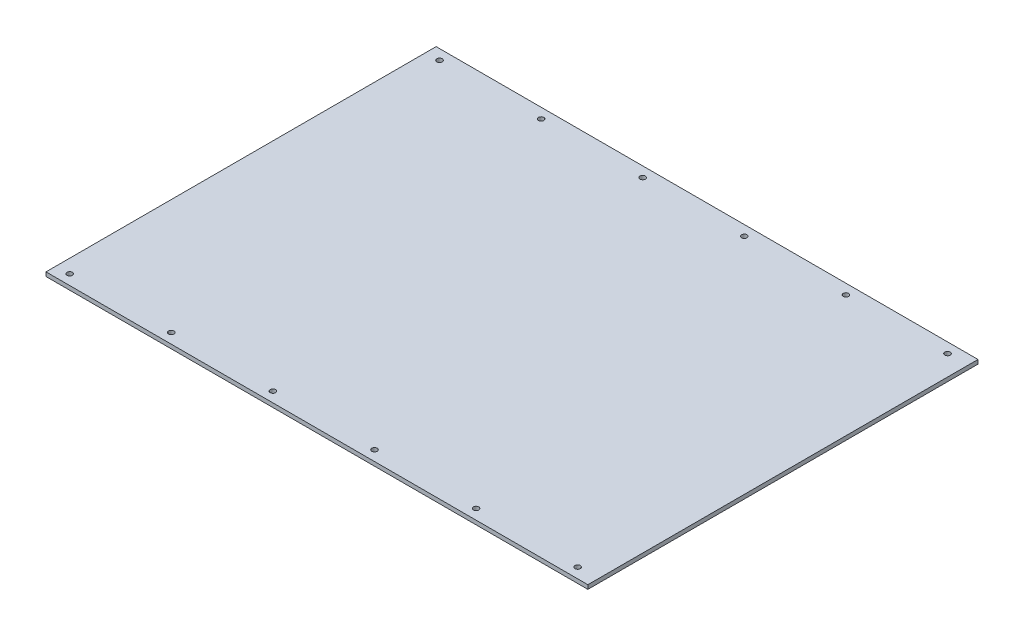
ISO-10303-21;
HEADER;
FILE_DESCRIPTION(('STEP AP214'),'2;1');
FILE_NAME('part.step','',(''),(''),'','','');
FILE_SCHEMA(('AUTOMOTIVE_DESIGN { 1 0 10303 214 1 1 1 1 }'));
ENDSEC;
DATA;
#1=APPLICATION_CONTEXT('core data for automotive mechanical design processes');
#2=APPLICATION_PROTOCOL_DEFINITION('international standard','automotive_design',2000,#1);
#3=PRODUCT_CONTEXT('',#1,'mechanical');
#4=PRODUCT('Part','Part','',(#3));
#5=PRODUCT_RELATED_PRODUCT_CATEGORY('part','',(#4));
#6=PRODUCT_DEFINITION_FORMATION('','',#4);
#7=PRODUCT_DEFINITION_CONTEXT('part definition',#1,'design');
#8=PRODUCT_DEFINITION('design','',#6,#7);
#9=PRODUCT_DEFINITION_SHAPE('','',#8);
#10=(LENGTH_UNIT() NAMED_UNIT(*) SI_UNIT(.MILLI.,.METRE.));
#11=(NAMED_UNIT(*) PLANE_ANGLE_UNIT() SI_UNIT($,.RADIAN.));
#12=(NAMED_UNIT(*) SI_UNIT($,.STERADIAN.) SOLID_ANGLE_UNIT());
#13=UNCERTAINTY_MEASURE_WITH_UNIT(LENGTH_MEASURE(1.E-05),#10,'distance_accuracy_value','');
#14=(GEOMETRIC_REPRESENTATION_CONTEXT(3) GLOBAL_UNCERTAINTY_ASSIGNED_CONTEXT((#13)) GLOBAL_UNIT_ASSIGNED_CONTEXT((#10,
#11,#12)) REPRESENTATION_CONTEXT('',''));
#15=CARTESIAN_POINT('',(0.,0.,0.));
#16=DIRECTION('',(0.,0.,1.));
#17=DIRECTION('',(1.,0.,0.));
#18=AXIS2_PLACEMENT_3D('',#15,#16,#17);
#19=CARTESIAN_POINT('',(-200.,3.,144.));
#20=DIRECTION('',(1.,0.,0.));
#21=DIRECTION('',(0.,0.,-1.));
#22=AXIS2_PLACEMENT_3D('',#19,#20,#21);
#23=PLANE('',#22);
#24=DIRECTION('',(0.,0.,1.));
#25=VECTOR('',#24,1.);
#26=CARTESIAN_POINT('',(-200.,0.,144.));
#27=LINE('',#26,#25);
#28=CARTESIAN_POINT('',(-200.,0.,-144.));
#29=VERTEX_POINT('',#28);
#30=CARTESIAN_POINT('',(-200.,0.,144.));
#31=VERTEX_POINT('',#30);
#32=EDGE_CURVE('E98',#29,#31,#27,.T.);
#33=ORIENTED_EDGE('',*,*,#32,.T.);
#34=DIRECTION('',(0.,-1.,0.));
#35=VECTOR('',#34,1.);
#36=CARTESIAN_POINT('',(-200.,3.,144.));
#37=LINE('',#36,#35);
#38=CARTESIAN_POINT('',(-200.,3.,144.));
#39=VERTEX_POINT('',#38);
#40=EDGE_CURVE('E11',#39,#31,#37,.T.);
#41=ORIENTED_EDGE('',*,*,#40,.F.);
#42=DIRECTION('',(0.,0.,1.));
#43=VECTOR('',#42,1.);
#44=CARTESIAN_POINT('',(-200.,3.,144.));
#45=LINE('',#44,#43);
#46=CARTESIAN_POINT('',(-200.,3.,-144.));
#47=VERTEX_POINT('',#46);
#48=EDGE_CURVE('E85',#47,#39,#45,.T.);
#49=ORIENTED_EDGE('',*,*,#48,.F.);
#50=DIRECTION('',(0.,-1.,0.));
#51=VECTOR('',#50,1.);
#52=CARTESIAN_POINT('',(-200.,3.,-144.));
#53=LINE('',#52,#51);
#54=EDGE_CURVE('E94',#47,#29,#53,.T.);
#55=ORIENTED_EDGE('',*,*,#54,.T.);
#56=EDGE_LOOP('',(#33,#41,#49,#55));
#57=FACE_BOUND('',#56,.T.);
#58=ADVANCED_FACE('F32',(#57),#23,.F.);
#59=CARTESIAN_POINT('',(200.,3.,144.));
#60=DIRECTION('',(0.,0.,-1.));
#61=DIRECTION('',(-1.,0.,0.));
#62=AXIS2_PLACEMENT_3D('',#59,#60,#61);
#63=PLANE('',#62);
#64=DIRECTION('',(1.,0.,0.));
#65=VECTOR('',#64,1.);
#66=CARTESIAN_POINT('',(200.,0.,144.));
#67=LINE('',#66,#65);
#68=CARTESIAN_POINT('',(200.,0.,144.));
#69=VERTEX_POINT('',#68);
#70=EDGE_CURVE('E89',#31,#69,#67,.T.);
#71=ORIENTED_EDGE('',*,*,#70,.T.);
#72=DIRECTION('',(0.,-1.,0.));
#73=VECTOR('',#72,1.);
#74=CARTESIAN_POINT('',(200.,3.,144.));
#75=LINE('',#74,#73);
#76=CARTESIAN_POINT('',(200.,3.,144.));
#77=VERTEX_POINT('',#76);
#78=EDGE_CURVE('E41',#77,#69,#75,.T.);
#79=ORIENTED_EDGE('',*,*,#78,.F.);
#80=DIRECTION('',(1.,0.,0.));
#81=VECTOR('',#80,1.);
#82=CARTESIAN_POINT('',(200.,3.,144.));
#83=LINE('',#82,#81);
#84=EDGE_CURVE('E80',#39,#77,#83,.T.);
#85=ORIENTED_EDGE('',*,*,#84,.F.);
#86=ORIENTED_EDGE('',*,*,#40,.T.);
#87=EDGE_LOOP('',(#71,#79,#85,#86));
#88=FACE_BOUND('',#87,.T.);
#89=ADVANCED_FACE('F88',(#88),#63,.F.);
#90=CARTESIAN_POINT('',(200.,3.,144.));
#91=DIRECTION('',(-1.,0.,0.));
#92=DIRECTION('',(0.,0.,1.));
#93=AXIS2_PLACEMENT_3D('',#90,#91,#92);
#94=PLANE('',#93);
#95=DIRECTION('',(0.,0.,-1.));
#96=VECTOR('',#95,1.);
#97=CARTESIAN_POINT('',(200.,0.,144.));
#98=LINE('',#97,#96);
#99=CARTESIAN_POINT('',(200.,0.,-144.));
#100=VERTEX_POINT('',#99);
#101=EDGE_CURVE('E67',#69,#100,#98,.T.);
#102=ORIENTED_EDGE('',*,*,#101,.T.);
#103=DIRECTION('',(0.,-1.,0.));
#104=VECTOR('',#103,1.);
#105=CARTESIAN_POINT('',(200.,3.,-144.));
#106=LINE('',#105,#104);
#107=CARTESIAN_POINT('',(200.,3.,-144.));
#108=VERTEX_POINT('',#107);
#109=EDGE_CURVE('E90',#108,#100,#106,.T.);
#110=ORIENTED_EDGE('',*,*,#109,.F.);
#111=DIRECTION('',(0.,0.,-1.));
#112=VECTOR('',#111,1.);
#113=CARTESIAN_POINT('',(200.,3.,144.));
#114=LINE('',#113,#112);
#115=EDGE_CURVE('E83',#77,#108,#114,.T.);
#116=ORIENTED_EDGE('',*,*,#115,.F.);
#117=ORIENTED_EDGE('',*,*,#78,.T.);
#118=EDGE_LOOP('',(#102,#110,#116,#117));
#119=FACE_BOUND('',#118,.T.);
#120=ADVANCED_FACE('F92',(#119),#94,.F.);
#121=CARTESIAN_POINT('',(200.,3.,-144.));
#122=DIRECTION('',(0.,0.,1.));
#123=DIRECTION('',(1.,0.,0.));
#124=AXIS2_PLACEMENT_3D('',#121,#122,#123);
#125=PLANE('',#124);
#126=DIRECTION('',(-1.,0.,0.));
#127=VECTOR('',#126,1.);
#128=CARTESIAN_POINT('',(200.,0.,-144.));
#129=LINE('',#128,#127);
#130=EDGE_CURVE('E73',#100,#29,#129,.T.);
#131=ORIENTED_EDGE('',*,*,#130,.T.);
#132=ORIENTED_EDGE('',*,*,#54,.F.);
#133=DIRECTION('',(-1.,0.,0.));
#134=VECTOR('',#133,1.);
#135=CARTESIAN_POINT('',(200.,3.,-144.));
#136=LINE('',#135,#134);
#137=EDGE_CURVE('E50',#108,#47,#136,.T.);
#138=ORIENTED_EDGE('',*,*,#137,.F.);
#139=ORIENTED_EDGE('',*,*,#109,.T.);
#140=EDGE_LOOP('',(#131,#132,#138,#139));
#141=FACE_BOUND('',#140,.T.);
#142=ADVANCED_FACE('F175',(#141),#125,.F.);
#143=CARTESIAN_POINT('',(0.,3.,0.));
#144=DIRECTION('',(0.,1.,0.));
#145=DIRECTION('',(0.,0.,1.));
#146=AXIS2_PLACEMENT_3D('',#143,#144,#145);
#147=PLANE('',#146);
#148=CARTESIAN_POINT('',(35.,3.,136.5));
#149=DIRECTION('',(0.,1.,0.));
#150=DIRECTION('',(0.,0.,-1.));
#151=AXIS2_PLACEMENT_3D('',#148,#149,#150);
#152=CIRCLE('',#151,2.);
#153=CARTESIAN_POINT('',(35.,3.,134.5));
#154=VERTEX_POINT('',#153);
#155=EDGE_CURVE('E346',#154,#154,#152,.T.);
#156=ORIENTED_EDGE('',*,*,#155,.F.);
#157=EDGE_LOOP('',(#156));
#158=FACE_BOUND('',#157,.T.);
#159=CARTESIAN_POINT('',(110.,3.,136.5));
#160=DIRECTION('',(0.,1.,0.));
#161=DIRECTION('',(0.,0.,-1.));
#162=AXIS2_PLACEMENT_3D('',#159,#160,#161);
#163=CIRCLE('',#162,2.);
#164=CARTESIAN_POINT('',(110.,3.,134.5));
#165=VERTEX_POINT('',#164);
#166=EDGE_CURVE('E340',#165,#165,#163,.T.);
#167=ORIENTED_EDGE('',*,*,#166,.F.);
#168=EDGE_LOOP('',(#167));
#169=FACE_BOUND('',#168,.T.);
#170=CARTESIAN_POINT('',(185.,3.,136.5));
#171=DIRECTION('',(0.,1.,0.));
#172=DIRECTION('',(0.,0.,-1.));
#173=AXIS2_PLACEMENT_3D('',#170,#171,#172);
#174=CIRCLE('',#173,2.);
#175=CARTESIAN_POINT('',(185.,3.,134.5));
#176=VERTEX_POINT('',#175);
#177=EDGE_CURVE('E308',#176,#176,#174,.T.);
#178=ORIENTED_EDGE('',*,*,#177,.F.);
#179=EDGE_LOOP('',(#178));
#180=FACE_BOUND('',#179,.T.);
#181=CARTESIAN_POINT('',(185.,3.,-136.5));
#182=DIRECTION('',(0.,1.,0.));
#183=DIRECTION('',(0.,0.,1.));
#184=AXIS2_PLACEMENT_3D('',#181,#182,#183);
#185=CIRCLE('',#184,2.);
#186=CARTESIAN_POINT('',(185.,3.,-134.5));
#187=VERTEX_POINT('',#186);
#188=EDGE_CURVE('E339',#187,#187,#185,.T.);
#189=ORIENTED_EDGE('',*,*,#188,.F.);
#190=EDGE_LOOP('',(#189));
#191=FACE_BOUND('',#190,.T.);
#192=CARTESIAN_POINT('',(110.,3.,-136.5));
#193=DIRECTION('',(0.,1.,0.));
#194=DIRECTION('',(0.,0.,1.));
#195=AXIS2_PLACEMENT_3D('',#192,#193,#194);
#196=CIRCLE('',#195,2.);
#197=CARTESIAN_POINT('',(110.,3.,-134.5));
#198=VERTEX_POINT('',#197);
#199=EDGE_CURVE('E343',#198,#198,#196,.T.);
#200=ORIENTED_EDGE('',*,*,#199,.F.);
#201=EDGE_LOOP('',(#200));
#202=FACE_BOUND('',#201,.T.);
#203=CARTESIAN_POINT('',(35.,3.,-136.5));
#204=DIRECTION('',(0.,1.,0.));
#205=DIRECTION('',(0.,0.,1.));
#206=AXIS2_PLACEMENT_3D('',#203,#204,#205);
#207=CIRCLE('',#206,2.);
#208=CARTESIAN_POINT('',(35.,3.,-134.5));
#209=VERTEX_POINT('',#208);
#210=EDGE_CURVE('E358',#209,#209,#207,.T.);
#211=ORIENTED_EDGE('',*,*,#210,.F.);
#212=EDGE_LOOP('',(#211));
#213=FACE_BOUND('',#212,.T.);
#214=CARTESIAN_POINT('',(-40.,3.,-136.5));
#215=DIRECTION('',(0.,1.,0.));
#216=DIRECTION('',(0.,0.,1.));
#217=AXIS2_PLACEMENT_3D('',#214,#215,#216);
#218=CIRCLE('',#217,2.);
#219=CARTESIAN_POINT('',(-40.,3.,-134.5));
#220=VERTEX_POINT('',#219);
#221=EDGE_CURVE('E355',#220,#220,#218,.T.);
#222=ORIENTED_EDGE('',*,*,#221,.F.);
#223=EDGE_LOOP('',(#222));
#224=FACE_BOUND('',#223,.T.);
#225=CARTESIAN_POINT('',(-115.,3.,-136.5));
#226=DIRECTION('',(0.,1.,0.));
#227=DIRECTION('',(0.,0.,1.));
#228=AXIS2_PLACEMENT_3D('',#225,#226,#227);
#229=CIRCLE('',#228,2.);
#230=CARTESIAN_POINT('',(-115.,3.,-134.5));
#231=VERTEX_POINT('',#230);
#232=EDGE_CURVE('E352',#231,#231,#229,.T.);
#233=ORIENTED_EDGE('',*,*,#232,.F.);
#234=EDGE_LOOP('',(#233));
#235=FACE_BOUND('',#234,.T.);
#236=CARTESIAN_POINT('',(-40.,3.,136.5));
#237=DIRECTION('',(0.,1.,0.));
#238=DIRECTION('',(0.,0.,-1.));
#239=AXIS2_PLACEMENT_3D('',#236,#237,#238);
#240=CIRCLE('',#239,2.);
#241=CARTESIAN_POINT('',(-40.,3.,134.5));
#242=VERTEX_POINT('',#241);
#243=EDGE_CURVE('E351',#242,#242,#240,.T.);
#244=ORIENTED_EDGE('',*,*,#243,.F.);
#245=EDGE_LOOP('',(#244));
#246=FACE_BOUND('',#245,.T.);
#247=CARTESIAN_POINT('',(-115.,3.,136.5));
#248=DIRECTION('',(0.,1.,0.));
#249=DIRECTION('',(0.,0.,-1.));
#250=AXIS2_PLACEMENT_3D('',#247,#248,#249);
#251=CIRCLE('',#250,2.);
#252=CARTESIAN_POINT('',(-115.,3.,134.5));
#253=VERTEX_POINT('',#252);
#254=EDGE_CURVE('E381',#253,#253,#251,.T.);
#255=ORIENTED_EDGE('',*,*,#254,.F.);
#256=EDGE_LOOP('',(#255));
#257=FACE_BOUND('',#256,.T.);
#258=CARTESIAN_POINT('',(-190.,3.,136.5));
#259=DIRECTION('',(0.,1.,0.));
#260=DIRECTION('',(0.,0.,-1.));
#261=AXIS2_PLACEMENT_3D('',#258,#259,#260);
#262=CIRCLE('',#261,2.);
#263=CARTESIAN_POINT('',(-190.,3.,134.5));
#264=VERTEX_POINT('',#263);
#265=EDGE_CURVE('E384',#264,#264,#262,.T.);
#266=ORIENTED_EDGE('',*,*,#265,.F.);
#267=EDGE_LOOP('',(#266));
#268=FACE_BOUND('',#267,.T.);
#269=CARTESIAN_POINT('',(-190.,3.,-136.5));
#270=DIRECTION('',(0.,1.,0.));
#271=DIRECTION('',(0.,0.,1.));
#272=AXIS2_PLACEMENT_3D('',#269,#270,#271);
#273=CIRCLE('',#272,2.);
#274=CARTESIAN_POINT('',(-190.,3.,-134.5));
#275=VERTEX_POINT('',#274);
#276=EDGE_CURVE('E110',#275,#275,#273,.T.);
#277=ORIENTED_EDGE('',*,*,#276,.F.);
#278=EDGE_LOOP('',(#277));
#279=FACE_BOUND('',#278,.T.);
#280=ORIENTED_EDGE('',*,*,#48,.T.);
#281=ORIENTED_EDGE('',*,*,#84,.T.);
#282=ORIENTED_EDGE('',*,*,#115,.T.);
#283=ORIENTED_EDGE('',*,*,#137,.T.);
#284=EDGE_LOOP('',(#280,#281,#282,#283));
#285=FACE_BOUND('',#284,.T.);
#286=ADVANCED_FACE('F81',(#158,#169,#180,#191,#202,#213,#224,#235,#246,#257,#268,#279,#285),
#147,.T.);
#287=CARTESIAN_POINT('',(0.,0.,0.));
#288=DIRECTION('',(0.,1.,0.));
#289=DIRECTION('',(0.,0.,1.));
#290=AXIS2_PLACEMENT_3D('',#287,#288,#289);
#291=PLANE('',#290);
#292=CARTESIAN_POINT('',(35.,0.,136.5));
#293=DIRECTION('',(0.,1.,0.));
#294=DIRECTION('',(0.,0.,1.));
#295=AXIS2_PLACEMENT_3D('',#292,#293,#294);
#296=CIRCLE('',#295,2.);
#297=CARTESIAN_POINT('',(35.,0.,138.5));
#298=VERTEX_POINT('',#297);
#299=EDGE_CURVE('E35',#298,#298,#296,.T.);
#300=ORIENTED_EDGE('',*,*,#299,.T.);
#301=EDGE_LOOP('',(#300));
#302=FACE_BOUND('',#301,.T.);
#303=CARTESIAN_POINT('',(110.,0.,136.5));
#304=DIRECTION('',(0.,1.,0.));
#305=DIRECTION('',(0.,0.,1.));
#306=AXIS2_PLACEMENT_3D('',#303,#304,#305);
#307=CIRCLE('',#306,2.);
#308=CARTESIAN_POINT('',(110.,0.,138.5));
#309=VERTEX_POINT('',#308);
#310=EDGE_CURVE('E136',#309,#309,#307,.T.);
#311=ORIENTED_EDGE('',*,*,#310,.T.);
#312=EDGE_LOOP('',(#311));
#313=FACE_BOUND('',#312,.T.);
#314=CARTESIAN_POINT('',(185.,0.,136.5));
#315=DIRECTION('',(0.,1.,0.));
#316=DIRECTION('',(0.,0.,1.));
#317=AXIS2_PLACEMENT_3D('',#314,#315,#316);
#318=CIRCLE('',#317,2.);
#319=CARTESIAN_POINT('',(185.,0.,138.5));
#320=VERTEX_POINT('',#319);
#321=EDGE_CURVE('E134',#320,#320,#318,.T.);
#322=ORIENTED_EDGE('',*,*,#321,.T.);
#323=EDGE_LOOP('',(#322));
#324=FACE_BOUND('',#323,.T.);
#325=CARTESIAN_POINT('',(185.,0.,-136.5));
#326=DIRECTION('',(0.,1.,0.));
#327=DIRECTION('',(0.,0.,1.));
#328=AXIS2_PLACEMENT_3D('',#325,#326,#327);
#329=CIRCLE('',#328,2.);
#330=CARTESIAN_POINT('',(185.,0.,-134.5));
#331=VERTEX_POINT('',#330);
#332=EDGE_CURVE('E131',#331,#331,#329,.T.);
#333=ORIENTED_EDGE('',*,*,#332,.T.);
#334=EDGE_LOOP('',(#333));
#335=FACE_BOUND('',#334,.T.);
#336=CARTESIAN_POINT('',(110.,0.,-136.5));
#337=DIRECTION('',(0.,1.,0.));
#338=DIRECTION('',(0.,0.,1.));
#339=AXIS2_PLACEMENT_3D('',#336,#337,#338);
#340=CIRCLE('',#339,2.);
#341=CARTESIAN_POINT('',(110.,0.,-134.5));
#342=VERTEX_POINT('',#341);
#343=EDGE_CURVE('E128',#342,#342,#340,.T.);
#344=ORIENTED_EDGE('',*,*,#343,.T.);
#345=EDGE_LOOP('',(#344));
#346=FACE_BOUND('',#345,.T.);
#347=CARTESIAN_POINT('',(35.,0.,-136.5));
#348=DIRECTION('',(0.,1.,0.));
#349=DIRECTION('',(0.,0.,1.));
#350=AXIS2_PLACEMENT_3D('',#347,#348,#349);
#351=CIRCLE('',#350,2.);
#352=CARTESIAN_POINT('',(35.,0.,-134.5));
#353=VERTEX_POINT('',#352);
#354=EDGE_CURVE('E125',#353,#353,#351,.T.);
#355=ORIENTED_EDGE('',*,*,#354,.T.);
#356=EDGE_LOOP('',(#355));
#357=FACE_BOUND('',#356,.T.);
#358=CARTESIAN_POINT('',(-40.,0.,-136.5));
#359=DIRECTION('',(0.,1.,0.));
#360=DIRECTION('',(0.,0.,1.));
#361=AXIS2_PLACEMENT_3D('',#358,#359,#360);
#362=CIRCLE('',#361,2.);
#363=CARTESIAN_POINT('',(-40.,0.,-134.5));
#364=VERTEX_POINT('',#363);
#365=EDGE_CURVE('E122',#364,#364,#362,.T.);
#366=ORIENTED_EDGE('',*,*,#365,.T.);
#367=EDGE_LOOP('',(#366));
#368=FACE_BOUND('',#367,.T.);
#369=CARTESIAN_POINT('',(-115.,0.,-136.5));
#370=DIRECTION('',(0.,1.,0.));
#371=DIRECTION('',(0.,0.,1.));
#372=AXIS2_PLACEMENT_3D('',#369,#370,#371);
#373=CIRCLE('',#372,2.);
#374=CARTESIAN_POINT('',(-115.,0.,-134.5));
#375=VERTEX_POINT('',#374);
#376=EDGE_CURVE('E119',#375,#375,#373,.T.);
#377=ORIENTED_EDGE('',*,*,#376,.T.);
#378=EDGE_LOOP('',(#377));
#379=FACE_BOUND('',#378,.T.);
#380=CARTESIAN_POINT('',(-40.,0.,136.5));
#381=DIRECTION('',(0.,1.,0.));
#382=DIRECTION('',(0.,0.,1.));
#383=AXIS2_PLACEMENT_3D('',#380,#381,#382);
#384=CIRCLE('',#383,2.);
#385=CARTESIAN_POINT('',(-40.,0.,138.5));
#386=VERTEX_POINT('',#385);
#387=EDGE_CURVE('E116',#386,#386,#384,.T.);
#388=ORIENTED_EDGE('',*,*,#387,.T.);
#389=EDGE_LOOP('',(#388));
#390=FACE_BOUND('',#389,.T.);
#391=CARTESIAN_POINT('',(-115.,0.,136.5));
#392=DIRECTION('',(0.,1.,0.));
#393=DIRECTION('',(0.,0.,1.));
#394=AXIS2_PLACEMENT_3D('',#391,#392,#393);
#395=CIRCLE('',#394,2.);
#396=CARTESIAN_POINT('',(-115.,0.,138.5));
#397=VERTEX_POINT('',#396);
#398=EDGE_CURVE('E113',#397,#397,#395,.T.);
#399=ORIENTED_EDGE('',*,*,#398,.T.);
#400=EDGE_LOOP('',(#399));
#401=FACE_BOUND('',#400,.T.);
#402=CARTESIAN_POINT('',(-190.,0.,136.5));
#403=DIRECTION('',(0.,1.,0.));
#404=DIRECTION('',(0.,0.,1.));
#405=AXIS2_PLACEMENT_3D('',#402,#403,#404);
#406=CIRCLE('',#405,2.);
#407=CARTESIAN_POINT('',(-190.,0.,138.5));
#408=VERTEX_POINT('',#407);
#409=EDGE_CURVE('E109',#408,#408,#406,.T.);
#410=ORIENTED_EDGE('',*,*,#409,.T.);
#411=EDGE_LOOP('',(#410));
#412=FACE_BOUND('',#411,.T.);
#413=CARTESIAN_POINT('',(-190.,0.,-136.5));
#414=DIRECTION('',(0.,1.,0.));
#415=DIRECTION('',(0.,0.,1.));
#416=AXIS2_PLACEMENT_3D('',#413,#414,#415);
#417=CIRCLE('',#416,2.);
#418=CARTESIAN_POINT('',(-190.,0.,-134.5));
#419=VERTEX_POINT('',#418);
#420=EDGE_CURVE('E106',#419,#419,#417,.T.);
#421=ORIENTED_EDGE('',*,*,#420,.T.);
#422=EDGE_LOOP('',(#421));
#423=FACE_BOUND('',#422,.T.);
#424=ORIENTED_EDGE('',*,*,#32,.F.);
#425=ORIENTED_EDGE('',*,*,#130,.F.);
#426=ORIENTED_EDGE('',*,*,#101,.F.);
#427=ORIENTED_EDGE('',*,*,#70,.F.);
#428=EDGE_LOOP('',(#424,#425,#426,#427));
#429=FACE_BOUND('',#428,.T.);
#430=ADVANCED_FACE('F143',(#302,#313,#324,#335,#346,#357,#368,#379,#390,#401,#412,#423,#429),
#291,.F.);
#431=CARTESIAN_POINT('',(-190.,-7.,-136.5));
#432=DIRECTION('',(0.,1.,0.));
#433=DIRECTION('',(0.,0.,1.));
#434=AXIS2_PLACEMENT_3D('',#431,#432,#433);
#435=CYLINDRICAL_SURFACE('',#434,2.);
#436=ORIENTED_EDGE('',*,*,#276,.T.);
#437=EDGE_LOOP('',(#436));
#438=FACE_BOUND('',#437,.T.);
#439=ORIENTED_EDGE('',*,*,#420,.F.);
#440=EDGE_LOOP('',(#439));
#441=FACE_BOUND('',#440,.T.);
#442=ADVANCED_FACE('F166',(#438,#441),#435,.F.);
#443=CARTESIAN_POINT('',(-190.,-7.,136.5));
#444=DIRECTION('',(0.,1.,0.));
#445=DIRECTION('',(0.,0.,1.));
#446=AXIS2_PLACEMENT_3D('',#443,#444,#445);
#447=CYLINDRICAL_SURFACE('',#446,2.);
#448=ORIENTED_EDGE('',*,*,#265,.T.);
#449=EDGE_LOOP('',(#448));
#450=FACE_BOUND('',#449,.T.);
#451=ORIENTED_EDGE('',*,*,#409,.F.);
#452=EDGE_LOOP('',(#451));
#453=FACE_BOUND('',#452,.T.);
#454=ADVANCED_FACE('F172',(#450,#453),#447,.F.);
#455=CARTESIAN_POINT('',(-115.,-7.,136.5));
#456=DIRECTION('',(0.,1.,0.));
#457=DIRECTION('',(0.,0.,1.));
#458=AXIS2_PLACEMENT_3D('',#455,#456,#457);
#459=CYLINDRICAL_SURFACE('',#458,2.);
#460=ORIENTED_EDGE('',*,*,#254,.T.);
#461=EDGE_LOOP('',(#460));
#462=FACE_BOUND('',#461,.T.);
#463=ORIENTED_EDGE('',*,*,#398,.F.);
#464=EDGE_LOOP('',(#463));
#465=FACE_BOUND('',#464,.T.);
#466=ADVANCED_FACE('F213',(#462,#465),#459,.F.);
#467=CARTESIAN_POINT('',(-40.,-7.,136.5));
#468=DIRECTION('',(0.,1.,0.));
#469=DIRECTION('',(0.,0.,1.));
#470=AXIS2_PLACEMENT_3D('',#467,#468,#469);
#471=CYLINDRICAL_SURFACE('',#470,2.);
#472=ORIENTED_EDGE('',*,*,#243,.T.);
#473=EDGE_LOOP('',(#472));
#474=FACE_BOUND('',#473,.T.);
#475=ORIENTED_EDGE('',*,*,#387,.F.);
#476=EDGE_LOOP('',(#475));
#477=FACE_BOUND('',#476,.T.);
#478=ADVANCED_FACE('F223',(#474,#477),#471,.F.);
#479=CARTESIAN_POINT('',(-115.,-7.,-136.5));
#480=DIRECTION('',(0.,1.,0.));
#481=DIRECTION('',(0.,0.,1.));
#482=AXIS2_PLACEMENT_3D('',#479,#480,#481);
#483=CYLINDRICAL_SURFACE('',#482,2.);
#484=ORIENTED_EDGE('',*,*,#232,.T.);
#485=EDGE_LOOP('',(#484));
#486=FACE_BOUND('',#485,.T.);
#487=ORIENTED_EDGE('',*,*,#376,.F.);
#488=EDGE_LOOP('',(#487));
#489=FACE_BOUND('',#488,.T.);
#490=ADVANCED_FACE('F233',(#486,#489),#483,.F.);
#491=CARTESIAN_POINT('',(-40.,-7.,-136.5));
#492=DIRECTION('',(0.,1.,0.));
#493=DIRECTION('',(0.,0.,1.));
#494=AXIS2_PLACEMENT_3D('',#491,#492,#493);
#495=CYLINDRICAL_SURFACE('',#494,2.);
#496=ORIENTED_EDGE('',*,*,#221,.T.);
#497=EDGE_LOOP('',(#496));
#498=FACE_BOUND('',#497,.T.);
#499=ORIENTED_EDGE('',*,*,#365,.F.);
#500=EDGE_LOOP('',(#499));
#501=FACE_BOUND('',#500,.T.);
#502=ADVANCED_FACE('F243',(#498,#501),#495,.F.);
#503=CARTESIAN_POINT('',(35.,-7.,-136.5));
#504=DIRECTION('',(0.,1.,0.));
#505=DIRECTION('',(0.,0.,1.));
#506=AXIS2_PLACEMENT_3D('',#503,#504,#505);
#507=CYLINDRICAL_SURFACE('',#506,2.);
#508=ORIENTED_EDGE('',*,*,#210,.T.);
#509=EDGE_LOOP('',(#508));
#510=FACE_BOUND('',#509,.T.);
#511=ORIENTED_EDGE('',*,*,#354,.F.);
#512=EDGE_LOOP('',(#511));
#513=FACE_BOUND('',#512,.T.);
#514=ADVANCED_FACE('F252',(#510,#513),#507,.F.);
#515=CARTESIAN_POINT('',(110.,-7.,-136.5));
#516=DIRECTION('',(0.,1.,0.));
#517=DIRECTION('',(0.,0.,1.));
#518=AXIS2_PLACEMENT_3D('',#515,#516,#517);
#519=CYLINDRICAL_SURFACE('',#518,2.);
#520=ORIENTED_EDGE('',*,*,#199,.T.);
#521=EDGE_LOOP('',(#520));
#522=FACE_BOUND('',#521,.T.);
#523=ORIENTED_EDGE('',*,*,#343,.F.);
#524=EDGE_LOOP('',(#523));
#525=FACE_BOUND('',#524,.T.);
#526=ADVANCED_FACE('F262',(#522,#525),#519,.F.);
#527=CARTESIAN_POINT('',(185.,-7.,-136.5));
#528=DIRECTION('',(0.,1.,0.));
#529=DIRECTION('',(0.,0.,1.));
#530=AXIS2_PLACEMENT_3D('',#527,#528,#529);
#531=CYLINDRICAL_SURFACE('',#530,2.);
#532=ORIENTED_EDGE('',*,*,#188,.T.);
#533=EDGE_LOOP('',(#532));
#534=FACE_BOUND('',#533,.T.);
#535=ORIENTED_EDGE('',*,*,#332,.F.);
#536=EDGE_LOOP('',(#535));
#537=FACE_BOUND('',#536,.T.);
#538=ADVANCED_FACE('F272',(#534,#537),#531,.F.);
#539=CARTESIAN_POINT('',(185.,-7.,136.5));
#540=DIRECTION('',(0.,1.,0.));
#541=DIRECTION('',(0.,0.,1.));
#542=AXIS2_PLACEMENT_3D('',#539,#540,#541);
#543=CYLINDRICAL_SURFACE('',#542,2.);
#544=ORIENTED_EDGE('',*,*,#177,.T.);
#545=EDGE_LOOP('',(#544));
#546=FACE_BOUND('',#545,.T.);
#547=ORIENTED_EDGE('',*,*,#321,.F.);
#548=EDGE_LOOP('',(#547));
#549=FACE_BOUND('',#548,.T.);
#550=ADVANCED_FACE('F153',(#546,#549),#543,.F.);
#551=CARTESIAN_POINT('',(110.,-7.,136.5));
#552=DIRECTION('',(0.,1.,0.));
#553=DIRECTION('',(0.,0.,1.));
#554=AXIS2_PLACEMENT_3D('',#551,#552,#553);
#555=CYLINDRICAL_SURFACE('',#554,2.);
#556=ORIENTED_EDGE('',*,*,#166,.T.);
#557=EDGE_LOOP('',(#556));
#558=FACE_BOUND('',#557,.T.);
#559=ORIENTED_EDGE('',*,*,#310,.F.);
#560=EDGE_LOOP('',(#559));
#561=FACE_BOUND('',#560,.T.);
#562=ADVANCED_FACE('F147',(#558,#561),#555,.F.);
#563=CARTESIAN_POINT('',(35.,-7.,136.5));
#564=DIRECTION('',(0.,1.,0.));
#565=DIRECTION('',(0.,0.,1.));
#566=AXIS2_PLACEMENT_3D('',#563,#564,#565);
#567=CYLINDRICAL_SURFACE('',#566,2.);
#568=ORIENTED_EDGE('',*,*,#155,.T.);
#569=EDGE_LOOP('',(#568));
#570=FACE_BOUND('',#569,.T.);
#571=ORIENTED_EDGE('',*,*,#299,.F.);
#572=EDGE_LOOP('',(#571));
#573=FACE_BOUND('',#572,.T.);
#574=ADVANCED_FACE('F145',(#570,#573),#567,.F.);
#575=CLOSED_SHELL('',(#58,#89,#120,#142,#286,#430,#442,#454,#466,#478,#490,#502,#514,#526,#538,
#550,#562,#574));
#576=MANIFOLD_SOLID_BREP('B2',#575);
#577=ADVANCED_BREP_SHAPE_REPRESENTATION('',(#18,#576),#14);
#578=SHAPE_DEFINITION_REPRESENTATION(#9,#577);
ENDSEC;
END-ISO-10303-21;
